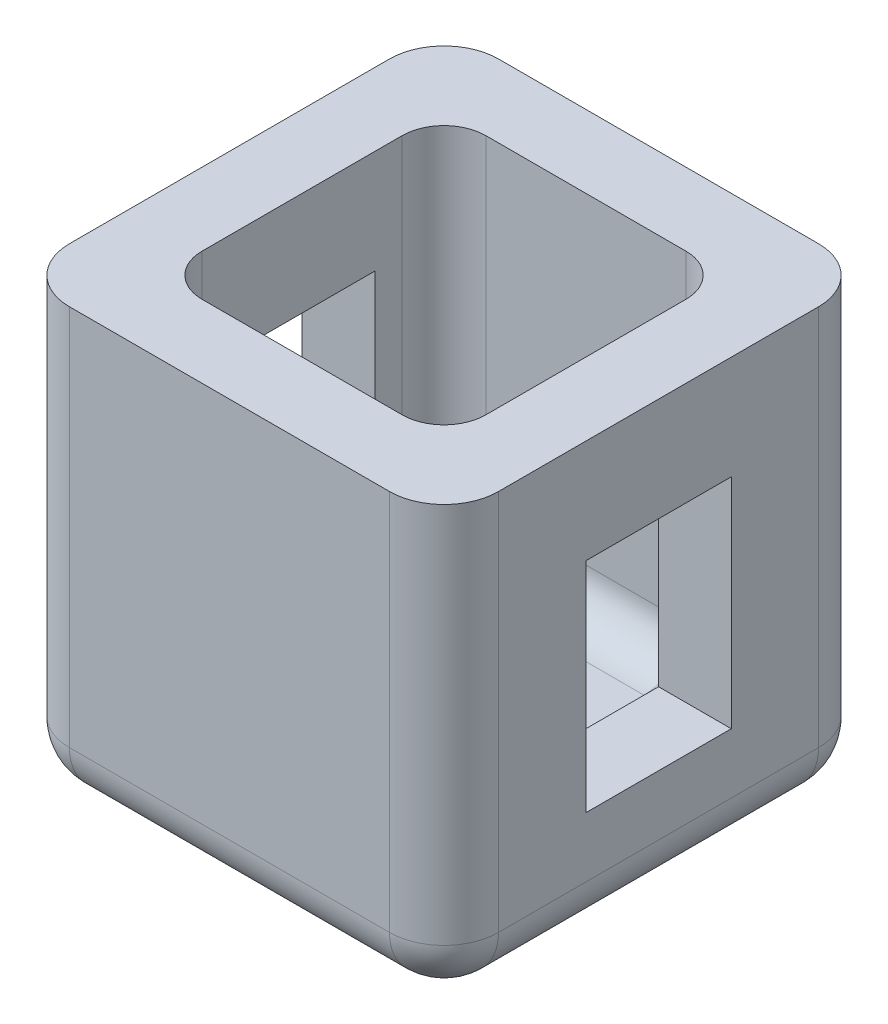
ISO-10303-21;
HEADER;
FILE_DESCRIPTION(('STEP AP214'),'2;1');
FILE_NAME('part.step','',(''),(''),'','','');
FILE_SCHEMA(('AUTOMOTIVE_DESIGN { 1 0 10303 214 1 1 1 1 }'));
ENDSEC;
DATA;
#1=APPLICATION_CONTEXT('core data for automotive mechanical design processes');
#2=APPLICATION_PROTOCOL_DEFINITION('international standard','automotive_design',2000,#1);
#3=PRODUCT_CONTEXT('',#1,'mechanical');
#4=PRODUCT('Part','Part','',(#3));
#5=PRODUCT_RELATED_PRODUCT_CATEGORY('part','',(#4));
#6=PRODUCT_DEFINITION_FORMATION('','',#4);
#7=PRODUCT_DEFINITION_CONTEXT('part definition',#1,'design');
#8=PRODUCT_DEFINITION('design','',#6,#7);
#9=PRODUCT_DEFINITION_SHAPE('','',#8);
#10=(LENGTH_UNIT() NAMED_UNIT(*) SI_UNIT(.MILLI.,.METRE.));
#11=(NAMED_UNIT(*) PLANE_ANGLE_UNIT() SI_UNIT($,.RADIAN.));
#12=(NAMED_UNIT(*) SI_UNIT($,.STERADIAN.) SOLID_ANGLE_UNIT());
#13=UNCERTAINTY_MEASURE_WITH_UNIT(LENGTH_MEASURE(1.E-05),#10,'distance_accuracy_value','');
#14=(GEOMETRIC_REPRESENTATION_CONTEXT(3) GLOBAL_UNCERTAINTY_ASSIGNED_CONTEXT((#13)) GLOBAL_UNIT_ASSIGNED_CONTEXT((#10,
#11,#12)) REPRESENTATION_CONTEXT('',''));
#15=CARTESIAN_POINT('',(0.,0.,0.));
#16=DIRECTION('',(0.,0.,1.));
#17=DIRECTION('',(1.,0.,0.));
#18=AXIS2_PLACEMENT_3D('',#15,#16,#17);
#19=CARTESIAN_POINT('',(-115.468503937008,240.,-69.6702755905512));
#20=DIRECTION('',(1.,0.,0.));
#21=DIRECTION('',(0.,0.,-1.));
#22=AXIS2_PLACEMENT_3D('',#19,#20,#21);
#23=PLANE('',#22);
#24=DIRECTION('',(0.,0.,1.));
#25=VECTOR('',#24,1.);
#26=CARTESIAN_POINT('',(-115.468503937008,183.,-69.6702755905512));
#27=LINE('',#26,#25);
#28=CARTESIAN_POINT('',(-115.468503937008,183.,8.32972440944884));
#29=VERTEX_POINT('',#28);
#30=CARTESIAN_POINT('',(-115.468503937008,183.,88.3297244094488));
#31=VERTEX_POINT('',#30);
#32=EDGE_CURVE('E300',#29,#31,#27,.T.);
#33=ORIENTED_EDGE('',*,*,#32,.T.);
#34=DIRECTION('',(0.,-1.,0.));
#35=VECTOR('',#34,1.);
#36=CARTESIAN_POINT('',(-115.468503937008,240.,88.3297244094488));
#37=LINE('',#36,#35);
#38=CARTESIAN_POINT('',(-115.468503937008,63.,88.3297244094488));
#39=VERTEX_POINT('',#38);
#40=EDGE_CURVE('E293',#31,#39,#37,.T.);
#41=ORIENTED_EDGE('',*,*,#40,.T.);
#42=DIRECTION('',(0.,0.,-1.));
#43=VECTOR('',#42,1.);
#44=CARTESIAN_POINT('',(-115.468503937008,63.,-69.6702755905512));
#45=LINE('',#44,#43);
#46=CARTESIAN_POINT('',(-115.468503937008,63.,8.32972440944879));
#47=VERTEX_POINT('',#46);
#48=EDGE_CURVE('E273',#39,#47,#45,.T.);
#49=ORIENTED_EDGE('',*,*,#48,.T.);
#50=DIRECTION('',(0.,1.,0.));
#51=VECTOR('',#50,1.);
#52=CARTESIAN_POINT('',(-115.468503937008,240.,8.32972440944886));
#53=LINE('',#52,#51);
#54=EDGE_CURVE('E282',#47,#29,#53,.T.);
#55=ORIENTED_EDGE('',*,*,#54,.T.);
#56=EDGE_LOOP('',(#33,#41,#49,#55));
#57=FACE_BOUND('',#56,.T.);
#58=DIRECTION('',(0.,0.,1.));
#59=VECTOR('',#58,1.);
#60=CARTESIAN_POINT('',(-115.468503937008,240.,-69.6702755905512));
#61=LINE('',#60,#59);
#62=CARTESIAN_POINT('',(-115.468503937008,240.,-39.6702755905512));
#63=VERTEX_POINT('',#62);
#64=CARTESIAN_POINT('',(-115.468503937008,240.,136.329724409449));
#65=VERTEX_POINT('',#64);
#66=EDGE_CURVE('E322',#63,#65,#61,.T.);
#67=ORIENTED_EDGE('',*,*,#66,.F.);
#68=DIRECTION('',(0.,-1.,0.));
#69=VECTOR('',#68,1.);
#70=CARTESIAN_POINT('',(-115.468503937008,240.,-39.6702755905512));
#71=LINE('',#70,#69);
#72=CARTESIAN_POINT('',(-115.468503937008,30.,-39.6702755905512));
#73=VERTEX_POINT('',#72);
#74=EDGE_CURVE('E498',#63,#73,#71,.T.);
#75=ORIENTED_EDGE('',*,*,#74,.T.);
#76=DIRECTION('',(0.,0.,1.));
#77=VECTOR('',#76,1.);
#78=CARTESIAN_POINT('',(-115.468503937008,30.,-69.6702755905512));
#79=LINE('',#78,#77);
#80=CARTESIAN_POINT('',(-115.468503937008,30.,136.329724409449));
#81=VERTEX_POINT('',#80);
#82=EDGE_CURVE('E495',#73,#81,#79,.T.);
#83=ORIENTED_EDGE('',*,*,#82,.T.);
#84=DIRECTION('',(0.,-1.,0.));
#85=VECTOR('',#84,1.);
#86=CARTESIAN_POINT('',(-115.468503937008,240.,136.329724409449));
#87=LINE('',#86,#85);
#88=EDGE_CURVE('E492',#81,#65,#87,.F.);
#89=ORIENTED_EDGE('',*,*,#88,.T.);
#90=EDGE_LOOP('',(#67,#75,#83,#89));
#91=FACE_BOUND('',#90,.T.);
#92=ADVANCED_FACE('F43',(#57,#91),#23,.F.);
#93=CARTESIAN_POINT('',(-115.468503937008,240.,166.329724409449));
#94=DIRECTION('',(0.,0.,-1.));
#95=DIRECTION('',(-1.,0.,0.));
#96=AXIS2_PLACEMENT_3D('',#93,#94,#95);
#97=PLANE('',#96);
#98=DIRECTION('',(1.,0.,0.));
#99=VECTOR('',#98,1.);
#100=CARTESIAN_POINT('',(-115.468503937008,240.,166.329724409449));
#101=LINE('',#100,#99);
#102=CARTESIAN_POINT('',(-85.4685039370078,240.,166.329724409449));
#103=VERTEX_POINT('',#102);
#104=CARTESIAN_POINT('',(90.5314960629922,240.,166.329724409449));
#105=VERTEX_POINT('',#104);
#106=EDGE_CURVE('E326',#103,#105,#101,.T.);
#107=ORIENTED_EDGE('',*,*,#106,.F.);
#108=DIRECTION('',(0.,-1.,0.));
#109=VECTOR('',#108,1.);
#110=CARTESIAN_POINT('',(-85.4685039370078,240.,166.329724409449));
#111=LINE('',#110,#109);
#112=CARTESIAN_POINT('',(-85.4685039370078,30.,166.329724409449));
#113=VERTEX_POINT('',#112);
#114=EDGE_CURVE('E458',#103,#113,#111,.T.);
#115=ORIENTED_EDGE('',*,*,#114,.T.);
#116=DIRECTION('',(1.,0.,0.));
#117=VECTOR('',#116,1.);
#118=CARTESIAN_POINT('',(-115.468503937008,30.,166.329724409449));
#119=LINE('',#118,#117);
#120=CARTESIAN_POINT('',(90.5314960629922,30.,166.329724409449));
#121=VERTEX_POINT('',#120);
#122=EDGE_CURVE('E454',#113,#121,#119,.T.);
#123=ORIENTED_EDGE('',*,*,#122,.T.);
#124=DIRECTION('',(0.,-1.,0.));
#125=VECTOR('',#124,1.);
#126=CARTESIAN_POINT('',(90.5314960629922,240.,166.329724409449));
#127=LINE('',#126,#125);
#128=EDGE_CURVE('E405',#121,#105,#127,.F.);
#129=ORIENTED_EDGE('',*,*,#128,.T.);
#130=EDGE_LOOP('',(#107,#115,#123,#129));
#131=FACE_BOUND('',#130,.T.);
#132=ADVANCED_FACE('F582',(#131),#97,.F.);
#133=CARTESIAN_POINT('',(120.531496062992,240.,-69.6702755905512));
#134=DIRECTION('',(-1.,0.,0.));
#135=DIRECTION('',(0.,0.,1.));
#136=AXIS2_PLACEMENT_3D('',#133,#134,#135);
#137=PLANE('',#136);
#138=DIRECTION('',(0.,0.,-1.));
#139=VECTOR('',#138,1.);
#140=CARTESIAN_POINT('',(120.531496062992,63.,88.3297244094488));
#141=LINE('',#140,#139);
#142=CARTESIAN_POINT('',(120.531496062992,63.,88.3297244094488));
#143=VERTEX_POINT('',#142);
#144=CARTESIAN_POINT('',(120.531496062992,63.,8.32972440944878));
#145=VERTEX_POINT('',#144);
#146=EDGE_CURVE('E244',#143,#145,#141,.T.);
#147=ORIENTED_EDGE('',*,*,#146,.F.);
#148=DIRECTION('',(0.,-1.,0.));
#149=VECTOR('',#148,1.);
#150=CARTESIAN_POINT('',(120.531496062992,183.,88.3297244094488));
#151=LINE('',#150,#149);
#152=CARTESIAN_POINT('',(120.531496062992,183.,88.3297244094488));
#153=VERTEX_POINT('',#152);
#154=EDGE_CURVE('E67',#153,#143,#151,.T.);
#155=ORIENTED_EDGE('',*,*,#154,.F.);
#156=DIRECTION('',(0.,0.,1.));
#157=VECTOR('',#156,1.);
#158=CARTESIAN_POINT('',(120.531496062992,183.,88.3297244094488));
#159=LINE('',#158,#157);
#160=CARTESIAN_POINT('',(120.531496062992,183.,8.32972440944883));
#161=VERTEX_POINT('',#160);
#162=EDGE_CURVE('E253',#161,#153,#159,.T.);
#163=ORIENTED_EDGE('',*,*,#162,.F.);
#164=DIRECTION('',(0.,1.,0.));
#165=VECTOR('',#164,1.);
#166=CARTESIAN_POINT('',(120.531496062992,183.,8.32972440944883));
#167=LINE('',#166,#165);
#168=EDGE_CURVE('E234',#145,#161,#167,.T.);
#169=ORIENTED_EDGE('',*,*,#168,.F.);
#170=EDGE_LOOP('',(#147,#155,#163,#169));
#171=FACE_BOUND('',#170,.T.);
#172=DIRECTION('',(0.,0.,-1.));
#173=VECTOR('',#172,1.);
#174=CARTESIAN_POINT('',(120.531496062992,30.,-69.6702755905512));
#175=LINE('',#174,#173);
#176=CARTESIAN_POINT('',(120.531496062992,30.,136.329724409449));
#177=VERTEX_POINT('',#176);
#178=CARTESIAN_POINT('',(120.531496062992,30.,-39.6702755905512));
#179=VERTEX_POINT('',#178);
#180=EDGE_CURVE('E477',#177,#179,#175,.T.);
#181=ORIENTED_EDGE('',*,*,#180,.T.);
#182=DIRECTION('',(0.,-1.,0.));
#183=VECTOR('',#182,1.);
#184=CARTESIAN_POINT('',(120.531496062992,240.,-39.6702755905512));
#185=LINE('',#184,#183);
#186=CARTESIAN_POINT('',(120.531496062992,240.,-39.6702755905512));
#187=VERTEX_POINT('',#186);
#188=EDGE_CURVE('E480',#179,#187,#185,.F.);
#189=ORIENTED_EDGE('',*,*,#188,.T.);
#190=DIRECTION('',(0.,0.,-1.));
#191=VECTOR('',#190,1.);
#192=CARTESIAN_POINT('',(120.531496062992,240.,-69.6702755905512));
#193=LINE('',#192,#191);
#194=CARTESIAN_POINT('',(120.531496062992,240.,136.329724409449));
#195=VERTEX_POINT('',#194);
#196=EDGE_CURVE('E330',#195,#187,#193,.T.);
#197=ORIENTED_EDGE('',*,*,#196,.F.);
#198=DIRECTION('',(0.,-1.,0.));
#199=VECTOR('',#198,1.);
#200=CARTESIAN_POINT('',(120.531496062992,240.,136.329724409449));
#201=LINE('',#200,#199);
#202=EDGE_CURVE('E474',#195,#177,#201,.T.);
#203=ORIENTED_EDGE('',*,*,#202,.T.);
#204=EDGE_LOOP('',(#181,#189,#197,#203));
#205=FACE_BOUND('',#204,.T.);
#206=ADVANCED_FACE('F250',(#171,#205),#137,.F.);
#207=CARTESIAN_POINT('',(-115.468503937008,240.,-69.6702755905512));
#208=DIRECTION('',(0.,0.,1.));
#209=DIRECTION('',(1.,0.,0.));
#210=AXIS2_PLACEMENT_3D('',#207,#208,#209);
#211=PLANE('',#210);
#212=DIRECTION('',(-1.,0.,0.));
#213=VECTOR('',#212,1.);
#214=CARTESIAN_POINT('',(-115.468503937008,30.,-69.6702755905512));
#215=LINE('',#214,#213);
#216=CARTESIAN_POINT('',(90.5314960629922,30.,-69.6702755905512));
#217=VERTEX_POINT('',#216);
#218=CARTESIAN_POINT('',(-85.4685039370079,30.,-69.6702755905512));
#219=VERTEX_POINT('',#218);
#220=EDGE_CURVE('E486',#217,#219,#215,.T.);
#221=ORIENTED_EDGE('',*,*,#220,.T.);
#222=DIRECTION('',(0.,-1.,0.));
#223=VECTOR('',#222,1.);
#224=CARTESIAN_POINT('',(-85.4685039370079,240.,-69.6702755905512));
#225=LINE('',#224,#223);
#226=CARTESIAN_POINT('',(-85.4685039370079,240.,-69.6702755905512));
#227=VERTEX_POINT('',#226);
#228=EDGE_CURVE('E489',#219,#227,#225,.F.);
#229=ORIENTED_EDGE('',*,*,#228,.T.);
#230=DIRECTION('',(-1.,0.,0.));
#231=VECTOR('',#230,1.);
#232=CARTESIAN_POINT('',(-115.468503937008,240.,-69.6702755905512));
#233=LINE('',#232,#231);
#234=CARTESIAN_POINT('',(90.5314960629921,240.,-69.6702755905512));
#235=VERTEX_POINT('',#234);
#236=EDGE_CURVE('E334',#235,#227,#233,.T.);
#237=ORIENTED_EDGE('',*,*,#236,.F.);
#238=DIRECTION('',(0.,-1.,0.));
#239=VECTOR('',#238,1.);
#240=CARTESIAN_POINT('',(90.5314960629922,240.,-69.6702755905512));
#241=LINE('',#240,#239);
#242=EDGE_CURVE('E483',#235,#217,#241,.T.);
#243=ORIENTED_EDGE('',*,*,#242,.T.);
#244=EDGE_LOOP('',(#221,#229,#237,#243));
#245=FACE_BOUND('',#244,.T.);
#246=ADVANCED_FACE('F611',(#245),#211,.F.);
#247=CARTESIAN_POINT('',(0.,240.,0.));
#248=DIRECTION('',(0.,1.,0.));
#249=DIRECTION('',(0.,0.,1.));
#250=AXIS2_PLACEMENT_3D('',#247,#248,#249);
#251=PLANE('',#250);
#252=DIRECTION('',(0.,0.,1.));
#253=VECTOR('',#252,1.);
#254=CARTESIAN_POINT('',(-75.4685039370079,240.,-69.6702755905512));
#255=LINE('',#254,#253);
#256=CARTESIAN_POINT('',(-75.4685039370078,240.,-6.67027559055121));
#257=VERTEX_POINT('',#256);
#258=CARTESIAN_POINT('',(-75.4685039370078,240.,103.329724409449));
#259=VERTEX_POINT('',#258);
#260=EDGE_CURVE('E305',#257,#259,#255,.T.);
#261=ORIENTED_EDGE('',*,*,#260,.F.);
#262=CARTESIAN_POINT('',(-52.4685039370079,240.,-6.6702755905512));
#263=DIRECTION('',(0.,1.,0.));
#264=DIRECTION('',(0.,0.,1.));
#265=AXIS2_PLACEMENT_3D('',#262,#263,#264);
#266=CIRCLE('',#265,23.);
#267=CARTESIAN_POINT('',(-52.4685039370079,240.,-29.6702755905512));
#268=VERTEX_POINT('',#267);
#269=EDGE_CURVE('E402',#257,#268,#266,.F.);
#270=ORIENTED_EDGE('',*,*,#269,.T.);
#271=DIRECTION('',(-1.,0.,0.));
#272=VECTOR('',#271,1.);
#273=CARTESIAN_POINT('',(-115.468503937008,240.,-29.6702755905512));
#274=LINE('',#273,#272);
#275=CARTESIAN_POINT('',(57.5314960629922,240.,-29.6702755905512));
#276=VERTEX_POINT('',#275);
#277=EDGE_CURVE('E318',#276,#268,#274,.T.);
#278=ORIENTED_EDGE('',*,*,#277,.F.);
#279=CARTESIAN_POINT('',(57.5314960629922,240.,-6.67027559055122));
#280=DIRECTION('',(0.,1.,0.));
#281=DIRECTION('',(0.,0.,1.));
#282=AXIS2_PLACEMENT_3D('',#279,#280,#281);
#283=CIRCLE('',#282,23.);
#284=CARTESIAN_POINT('',(80.5314960629922,240.,-6.67027559055122));
#285=VERTEX_POINT('',#284);
#286=EDGE_CURVE('E393',#276,#285,#283,.F.);
#287=ORIENTED_EDGE('',*,*,#286,.T.);
#288=DIRECTION('',(0.,0.,-1.));
#289=VECTOR('',#288,1.);
#290=CARTESIAN_POINT('',(80.5314960629922,240.,-69.6702755905512));
#291=LINE('',#290,#289);
#292=CARTESIAN_POINT('',(80.5314960629922,240.,103.329724409449));
#293=VERTEX_POINT('',#292);
#294=EDGE_CURVE('E314',#293,#285,#291,.T.);
#295=ORIENTED_EDGE('',*,*,#294,.F.);
#296=CARTESIAN_POINT('',(57.5314960629922,240.,103.329724409449));
#297=DIRECTION('',(0.,1.,0.));
#298=DIRECTION('',(0.,0.,1.));
#299=AXIS2_PLACEMENT_3D('',#296,#297,#298);
#300=CIRCLE('',#299,23.);
#301=CARTESIAN_POINT('',(57.5314960629922,240.,126.329724409449));
#302=VERTEX_POINT('',#301);
#303=EDGE_CURVE('E396',#293,#302,#300,.F.);
#304=ORIENTED_EDGE('',*,*,#303,.T.);
#305=DIRECTION('',(1.,0.,0.));
#306=VECTOR('',#305,1.);
#307=CARTESIAN_POINT('',(-115.468503937008,240.,126.329724409449));
#308=LINE('',#307,#306);
#309=CARTESIAN_POINT('',(-52.4685039370078,240.,126.329724409449));
#310=VERTEX_POINT('',#309);
#311=EDGE_CURVE('E309',#310,#302,#308,.T.);
#312=ORIENTED_EDGE('',*,*,#311,.F.);
#313=CARTESIAN_POINT('',(-52.4685039370078,240.,103.329724409449));
#314=DIRECTION('',(0.,1.,0.));
#315=DIRECTION('',(0.,0.,1.));
#316=AXIS2_PLACEMENT_3D('',#313,#314,#315);
#317=CIRCLE('',#316,23.);
#318=EDGE_CURVE('E399',#310,#259,#317,.F.);
#319=ORIENTED_EDGE('',*,*,#318,.T.);
#320=EDGE_LOOP('',(#261,#270,#278,#287,#295,#304,#312,#319));
#321=FACE_BOUND('',#320,.T.);
#322=ORIENTED_EDGE('',*,*,#236,.T.);
#323=CARTESIAN_POINT('',(-85.4685039370079,240.,-39.6702755905512));
#324=DIRECTION('',(0.,1.,0.));
#325=DIRECTION('',(0.,0.,1.));
#326=AXIS2_PLACEMENT_3D('',#323,#324,#325);
#327=CIRCLE('',#326,30.);
#328=EDGE_CURVE('E52',#227,#63,#327,.T.);
#329=ORIENTED_EDGE('',*,*,#328,.T.);
#330=ORIENTED_EDGE('',*,*,#66,.T.);
#331=CARTESIAN_POINT('',(-85.4685039370078,240.,136.329724409449));
#332=DIRECTION('',(0.,1.,0.));
#333=DIRECTION('',(0.,0.,1.));
#334=AXIS2_PLACEMENT_3D('',#331,#332,#333);
#335=CIRCLE('',#334,30.);
#336=EDGE_CURVE('E504',#65,#103,#335,.T.);
#337=ORIENTED_EDGE('',*,*,#336,.T.);
#338=ORIENTED_EDGE('',*,*,#106,.T.);
#339=CARTESIAN_POINT('',(90.5314960629922,240.,136.329724409449));
#340=DIRECTION('',(0.,1.,0.));
#341=DIRECTION('',(0.,0.,1.));
#342=AXIS2_PLACEMENT_3D('',#339,#340,#341);
#343=CIRCLE('',#342,30.);
#344=EDGE_CURVE('E501',#105,#195,#343,.T.);
#345=ORIENTED_EDGE('',*,*,#344,.T.);
#346=ORIENTED_EDGE('',*,*,#196,.T.);
#347=CARTESIAN_POINT('',(90.5314960629922,240.,-39.6702755905512));
#348=DIRECTION('',(0.,1.,0.));
#349=DIRECTION('',(0.,0.,1.));
#350=AXIS2_PLACEMENT_3D('',#347,#348,#349);
#351=CIRCLE('',#350,30.);
#352=EDGE_CURVE('E507',#187,#235,#351,.T.);
#353=ORIENTED_EDGE('',*,*,#352,.T.);
#354=EDGE_LOOP('',(#322,#329,#330,#337,#338,#345,#346,#353));
#355=FACE_BOUND('',#354,.T.);
#356=ADVANCED_FACE('F579',(#321,#355),#251,.T.);
#357=CARTESIAN_POINT('',(0.,0.,0.));
#358=DIRECTION('',(0.,1.,0.));
#359=DIRECTION('',(0.,0.,1.));
#360=AXIS2_PLACEMENT_3D('',#357,#358,#359);
#361=PLANE('',#360);
#362=DIRECTION('',(0.,0.,-1.));
#363=VECTOR('',#362,1.);
#364=CARTESIAN_POINT('',(90.5314960629922,0.,0.));
#365=LINE('',#364,#363);
#366=CARTESIAN_POINT('',(90.5314960629922,0.,-39.6702755905512));
#367=VERTEX_POINT('',#366);
#368=CARTESIAN_POINT('',(90.5314960629922,0.,136.329724409449));
#369=VERTEX_POINT('',#368);
#370=EDGE_CURVE('E467',#367,#369,#365,.F.);
#371=ORIENTED_EDGE('',*,*,#370,.T.);
#372=DIRECTION('',(1.,0.,0.));
#373=VECTOR('',#372,1.);
#374=CARTESIAN_POINT('',(0.,0.,136.329724409449));
#375=LINE('',#374,#373);
#376=CARTESIAN_POINT('',(-85.4685039370078,0.,136.329724409449));
#377=VERTEX_POINT('',#376);
#378=EDGE_CURVE('E470',#369,#377,#375,.F.);
#379=ORIENTED_EDGE('',*,*,#378,.T.);
#380=DIRECTION('',(0.,0.,1.));
#381=VECTOR('',#380,1.);
#382=CARTESIAN_POINT('',(-85.4685039370078,0.,0.));
#383=LINE('',#382,#381);
#384=CARTESIAN_POINT('',(-85.4685039370079,0.,-39.6702755905512));
#385=VERTEX_POINT('',#384);
#386=EDGE_CURVE('E461',#377,#385,#383,.F.);
#387=ORIENTED_EDGE('',*,*,#386,.T.);
#388=DIRECTION('',(-1.,0.,0.));
#389=VECTOR('',#388,1.);
#390=CARTESIAN_POINT('',(0.,0.,-39.6702755905512));
#391=LINE('',#390,#389);
#392=EDGE_CURVE('E464',#385,#367,#391,.F.);
#393=ORIENTED_EDGE('',*,*,#392,.T.);
#394=EDGE_LOOP('',(#371,#379,#387,#393));
#395=FACE_BOUND('',#394,.T.);
#396=ADVANCED_FACE('F607',(#395),#361,.F.);
#397=CARTESIAN_POINT('',(-75.4685039370079,240.,-69.6702755905512));
#398=DIRECTION('',(1.,0.,0.));
#399=DIRECTION('',(0.,0.,-1.));
#400=AXIS2_PLACEMENT_3D('',#397,#398,#399);
#401=PLANE('',#400);
#402=DIRECTION('',(0.,-1.,0.));
#403=VECTOR('',#402,1.);
#404=CARTESIAN_POINT('',(-75.4685039370078,240.,88.3297244094488));
#405=LINE('',#404,#403);
#406=CARTESIAN_POINT('',(-75.4685039370078,183.,88.3297244094488));
#407=VERTEX_POINT('',#406);
#408=CARTESIAN_POINT('',(-75.4685039370078,63.,88.3297244094488));
#409=VERTEX_POINT('',#408);
#410=EDGE_CURVE('E289',#407,#409,#405,.T.);
#411=ORIENTED_EDGE('',*,*,#410,.F.);
#412=DIRECTION('',(0.,0.,1.));
#413=VECTOR('',#412,1.);
#414=CARTESIAN_POINT('',(-75.4685039370079,183.,-69.6702755905512));
#415=LINE('',#414,#413);
#416=CARTESIAN_POINT('',(-75.4685039370078,183.,8.32972440944884));
#417=VERTEX_POINT('',#416);
#418=EDGE_CURVE('E297',#417,#407,#415,.T.);
#419=ORIENTED_EDGE('',*,*,#418,.F.);
#420=DIRECTION('',(0.,1.,0.));
#421=VECTOR('',#420,1.);
#422=CARTESIAN_POINT('',(-75.4685039370078,240.,8.32972440944886));
#423=LINE('',#422,#421);
#424=CARTESIAN_POINT('',(-75.4685039370079,63.,8.3297244094488));
#425=VERTEX_POINT('',#424);
#426=EDGE_CURVE('E279',#425,#417,#423,.T.);
#427=ORIENTED_EDGE('',*,*,#426,.F.);
#428=DIRECTION('',(0.,0.,1.));
#429=VECTOR('',#428,1.);
#430=CARTESIAN_POINT('',(-75.4685039370079,63.,-29.6702755905512));
#431=LINE('',#430,#429);
#432=CARTESIAN_POINT('',(-75.4685039370078,63.,-6.6702755905512));
#433=VERTEX_POINT('',#432);
#434=EDGE_CURVE('E384',#425,#433,#431,.F.);
#435=ORIENTED_EDGE('',*,*,#434,.T.);
#436=DIRECTION('',(0.,-1.,0.));
#437=VECTOR('',#436,1.);
#438=CARTESIAN_POINT('',(-75.4685039370078,240.,-6.6702755905512));
#439=LINE('',#438,#437);
#440=EDGE_CURVE('E381',#433,#257,#439,.F.);
#441=ORIENTED_EDGE('',*,*,#440,.T.);
#442=ORIENTED_EDGE('',*,*,#260,.T.);
#443=DIRECTION('',(0.,-1.,0.));
#444=VECTOR('',#443,1.);
#445=CARTESIAN_POINT('',(-75.4685039370078,40.,103.329724409449));
#446=LINE('',#445,#444);
#447=CARTESIAN_POINT('',(-75.4685039370078,63.,103.329724409449));
#448=VERTEX_POINT('',#447);
#449=EDGE_CURVE('E389',#259,#448,#446,.T.);
#450=ORIENTED_EDGE('',*,*,#449,.T.);
#451=EDGE_CURVE('E385',#448,#409,#431,.F.);
#452=ORIENTED_EDGE('',*,*,#451,.T.);
#453=EDGE_LOOP('',(#411,#419,#427,#435,#441,#442,#450,#452));
#454=FACE_BOUND('',#453,.T.);
#455=ADVANCED_FACE('F1009',(#454),#401,.T.);
#456=CARTESIAN_POINT('',(-115.468503937008,240.,126.329724409449));
#457=DIRECTION('',(0.,0.,-1.));
#458=DIRECTION('',(-1.,0.,0.));
#459=AXIS2_PLACEMENT_3D('',#456,#457,#458);
#460=PLANE('',#459);
#461=ORIENTED_EDGE('',*,*,#311,.T.);
#462=DIRECTION('',(0.,-1.,0.));
#463=VECTOR('',#462,1.);
#464=CARTESIAN_POINT('',(57.5314960629922,40.,126.329724409449));
#465=LINE('',#464,#463);
#466=CARTESIAN_POINT('',(57.5314960629922,63.,126.329724409449));
#467=VERTEX_POINT('',#466);
#468=EDGE_CURVE('E378',#302,#467,#465,.T.);
#469=ORIENTED_EDGE('',*,*,#468,.T.);
#470=DIRECTION('',(1.,0.,0.));
#471=VECTOR('',#470,1.);
#472=CARTESIAN_POINT('',(-75.4685039370078,63.,126.329724409449));
#473=LINE('',#472,#471);
#474=CARTESIAN_POINT('',(-52.4685039370078,63.,126.329724409449));
#475=VERTEX_POINT('',#474);
#476=EDGE_CURVE('E375',#467,#475,#473,.F.);
#477=ORIENTED_EDGE('',*,*,#476,.T.);
#478=DIRECTION('',(0.,-1.,0.));
#479=VECTOR('',#478,1.);
#480=CARTESIAN_POINT('',(-52.4685039370078,240.,126.329724409449));
#481=LINE('',#480,#479);
#482=EDGE_CURVE('E372',#475,#310,#481,.F.);
#483=ORIENTED_EDGE('',*,*,#482,.T.);
#484=EDGE_LOOP('',(#461,#469,#477,#483));
#485=FACE_BOUND('',#484,.T.);
#486=ADVANCED_FACE('F998',(#485),#460,.T.);
#487=CARTESIAN_POINT('',(80.5314960629922,240.,-69.6702755905512));
#488=DIRECTION('',(-1.,0.,0.));
#489=DIRECTION('',(0.,0.,1.));
#490=AXIS2_PLACEMENT_3D('',#487,#488,#489);
#491=PLANE('',#490);
#492=DIRECTION('',(0.,1.,0.));
#493=VECTOR('',#492,1.);
#494=CARTESIAN_POINT('',(80.5314960629922,240.,88.3297244094488));
#495=LINE('',#494,#493);
#496=CARTESIAN_POINT('',(80.5314960629922,63.,88.3297244094488));
#497=VERTEX_POINT('',#496);
#498=CARTESIAN_POINT('',(80.5314960629922,183.,88.3297244094488));
#499=VERTEX_POINT('',#498);
#500=EDGE_CURVE('E286',#497,#499,#495,.T.);
#501=ORIENTED_EDGE('',*,*,#500,.F.);
#502=DIRECTION('',(0.,0.,-1.));
#503=VECTOR('',#502,1.);
#504=CARTESIAN_POINT('',(80.5314960629922,63.,126.329724409449));
#505=LINE('',#504,#503);
#506=CARTESIAN_POINT('',(80.5314960629922,63.,103.329724409449));
#507=VERTEX_POINT('',#506);
#508=EDGE_CURVE('E364',#497,#507,#505,.F.);
#509=ORIENTED_EDGE('',*,*,#508,.T.);
#510=DIRECTION('',(0.,-1.,0.));
#511=VECTOR('',#510,1.);
#512=CARTESIAN_POINT('',(80.5314960629922,240.,103.329724409449));
#513=LINE('',#512,#511);
#514=EDGE_CURVE('E361',#507,#293,#513,.F.);
#515=ORIENTED_EDGE('',*,*,#514,.T.);
#516=ORIENTED_EDGE('',*,*,#294,.T.);
#517=DIRECTION('',(0.,-1.,0.));
#518=VECTOR('',#517,1.);
#519=CARTESIAN_POINT('',(80.5314960629922,40.,-6.67027559055122));
#520=LINE('',#519,#518);
#521=CARTESIAN_POINT('',(80.5314960629922,63.,-6.67027559055122));
#522=VERTEX_POINT('',#521);
#523=EDGE_CURVE('E369',#285,#522,#520,.T.);
#524=ORIENTED_EDGE('',*,*,#523,.T.);
#525=CARTESIAN_POINT('',(80.5314960629922,63.,8.32972440944879));
#526=VERTEX_POINT('',#525);
#527=EDGE_CURVE('E365',#522,#526,#505,.F.);
#528=ORIENTED_EDGE('',*,*,#527,.T.);
#529=DIRECTION('',(0.,-1.,0.));
#530=VECTOR('',#529,1.);
#531=CARTESIAN_POINT('',(80.5314960629922,240.,8.32972440944886));
#532=LINE('',#531,#530);
#533=CARTESIAN_POINT('',(80.5314960629922,183.,8.32972440944883));
#534=VERTEX_POINT('',#533);
#535=EDGE_CURVE('E237',#534,#526,#532,.T.);
#536=ORIENTED_EDGE('',*,*,#535,.F.);
#537=DIRECTION('',(0.,0.,-1.));
#538=VECTOR('',#537,1.);
#539=CARTESIAN_POINT('',(80.5314960629922,183.,-69.6702755905512));
#540=LINE('',#539,#538);
#541=EDGE_CURVE('E11',#499,#534,#540,.T.);
#542=ORIENTED_EDGE('',*,*,#541,.F.);
#543=EDGE_LOOP('',(#501,#509,#515,#516,#524,#528,#536,#542));
#544=FACE_BOUND('',#543,.T.);
#545=ADVANCED_FACE('F987',(#544),#491,.T.);
#546=CARTESIAN_POINT('',(-115.468503937008,240.,-29.6702755905512));
#547=DIRECTION('',(0.,0.,1.));
#548=DIRECTION('',(1.,0.,0.));
#549=AXIS2_PLACEMENT_3D('',#546,#547,#548);
#550=PLANE('',#549);
#551=DIRECTION('',(-1.,0.,0.));
#552=VECTOR('',#551,1.);
#553=CARTESIAN_POINT('',(80.5314960629922,63.,-29.6702755905512));
#554=LINE('',#553,#552);
#555=CARTESIAN_POINT('',(-52.4685039370079,63.,-29.6702755905512));
#556=VERTEX_POINT('',#555);
#557=CARTESIAN_POINT('',(57.5314960629922,63.,-29.6702755905512));
#558=VERTEX_POINT('',#557);
#559=EDGE_CURVE('E354',#556,#558,#554,.F.);
#560=ORIENTED_EDGE('',*,*,#559,.T.);
#561=DIRECTION('',(0.,-1.,0.));
#562=VECTOR('',#561,1.);
#563=CARTESIAN_POINT('',(57.5314960629922,240.,-29.6702755905512));
#564=LINE('',#563,#562);
#565=EDGE_CURVE('E358',#558,#276,#564,.F.);
#566=ORIENTED_EDGE('',*,*,#565,.T.);
#567=ORIENTED_EDGE('',*,*,#277,.T.);
#568=DIRECTION('',(0.,-1.,0.));
#569=VECTOR('',#568,1.);
#570=CARTESIAN_POINT('',(-52.4685039370079,40.,-29.6702755905512));
#571=LINE('',#570,#569);
#572=EDGE_CURVE('E351',#268,#556,#571,.T.);
#573=ORIENTED_EDGE('',*,*,#572,.T.);
#574=EDGE_LOOP('',(#560,#566,#567,#573));
#575=FACE_BOUND('',#574,.T.);
#576=ADVANCED_FACE('F976',(#575),#550,.T.);
#577=CARTESIAN_POINT('',(0.,40.,0.));
#578=DIRECTION('',(0.,1.,0.));
#579=DIRECTION('',(0.,0.,1.));
#580=AXIS2_PLACEMENT_3D('',#577,#578,#579);
#581=PLANE('',#580);
#582=DIRECTION('',(0.,0.,-1.));
#583=VECTOR('',#582,1.);
#584=CARTESIAN_POINT('',(57.5314960629922,40.,-29.6702755905512));
#585=LINE('',#584,#583);
#586=CARTESIAN_POINT('',(57.5314960629922,40.,103.329724409449));
#587=VERTEX_POINT('',#586);
#588=CARTESIAN_POINT('',(57.5314960629922,40.,-6.6702755905512));
#589=VERTEX_POINT('',#588);
#590=EDGE_CURVE('E344',#587,#589,#585,.T.);
#591=ORIENTED_EDGE('',*,*,#590,.T.);
#592=DIRECTION('',(-1.,0.,0.));
#593=VECTOR('',#592,1.);
#594=CARTESIAN_POINT('',(-75.4685039370079,40.,-6.6702755905512));
#595=LINE('',#594,#593);
#596=CARTESIAN_POINT('',(-52.4685039370079,40.,-6.6702755905512));
#597=VERTEX_POINT('',#596);
#598=EDGE_CURVE('E347',#589,#597,#595,.T.);
#599=ORIENTED_EDGE('',*,*,#598,.T.);
#600=DIRECTION('',(0.,0.,1.));
#601=VECTOR('',#600,1.);
#602=CARTESIAN_POINT('',(-52.4685039370078,40.,126.329724409449));
#603=LINE('',#602,#601);
#604=CARTESIAN_POINT('',(-52.4685039370078,40.,103.329724409449));
#605=VERTEX_POINT('',#604);
#606=EDGE_CURVE('E338',#597,#605,#603,.T.);
#607=ORIENTED_EDGE('',*,*,#606,.T.);
#608=DIRECTION('',(1.,0.,0.));
#609=VECTOR('',#608,1.);
#610=CARTESIAN_POINT('',(80.5314960629922,40.,103.329724409449));
#611=LINE('',#610,#609);
#612=EDGE_CURVE('E341',#605,#587,#611,.T.);
#613=ORIENTED_EDGE('',*,*,#612,.T.);
#614=EDGE_LOOP('',(#591,#599,#607,#613));
#615=FACE_BOUND('',#614,.T.);
#616=ADVANCED_FACE('F675',(#615),#581,.T.);
#617=CARTESIAN_POINT('',(57.5314960629922,240.,103.329724409449));
#618=DIRECTION('',(0.,1.,0.));
#619=DIRECTION('',(0.,0.,1.));
#620=AXIS2_PLACEMENT_3D('',#617,#618,#619);
#621=CYLINDRICAL_SURFACE('',#620,23.);
#622=ORIENTED_EDGE('',*,*,#303,.F.);
#623=ORIENTED_EDGE('',*,*,#514,.F.);
#624=CARTESIAN_POINT('',(57.5314960629922,63.,103.329724409449));
#625=DIRECTION('',(0.,1.,0.));
#626=DIRECTION('',(0.,0.,1.));
#627=AXIS2_PLACEMENT_3D('',#624,#625,#626);
#628=CIRCLE('',#627,23.);
#629=EDGE_CURVE('E310',#467,#507,#628,.T.);
#630=ORIENTED_EDGE('',*,*,#629,.F.);
#631=ORIENTED_EDGE('',*,*,#468,.F.);
#632=EDGE_LOOP('',(#622,#623,#630,#631));
#633=FACE_BOUND('',#632,.T.);
#634=ADVANCED_FACE('F671',(#633),#621,.F.);
#635=CARTESIAN_POINT('',(0.,63.,103.329724409449));
#636=DIRECTION('',(-1.,0.,0.));
#637=DIRECTION('',(0.,0.,1.));
#638=AXIS2_PLACEMENT_3D('',#635,#636,#637);
#639=CYLINDRICAL_SURFACE('',#638,23.);
#640=CARTESIAN_POINT('',(-52.4685039370078,63.,103.329724409449));
#641=DIRECTION('',(1.,0.,0.));
#642=DIRECTION('',(0.,0.,-1.));
#643=AXIS2_PLACEMENT_3D('',#640,#641,#642);
#644=CIRCLE('',#643,23.);
#645=EDGE_CURVE('E441',#475,#605,#644,.T.);
#646=ORIENTED_EDGE('',*,*,#645,.F.);
#647=ORIENTED_EDGE('',*,*,#476,.F.);
#648=CARTESIAN_POINT('',(57.5314960629922,63.,103.329724409449));
#649=DIRECTION('',(-1.,0.,0.));
#650=DIRECTION('',(0.,0.,1.));
#651=AXIS2_PLACEMENT_3D('',#648,#649,#650);
#652=CIRCLE('',#651,23.);
#653=EDGE_CURVE('E445',#587,#467,#652,.T.);
#654=ORIENTED_EDGE('',*,*,#653,.F.);
#655=ORIENTED_EDGE('',*,*,#612,.F.);
#656=EDGE_LOOP('',(#646,#647,#654,#655));
#657=FACE_BOUND('',#656,.T.);
#658=ADVANCED_FACE('F667',(#657),#639,.F.);
#659=CARTESIAN_POINT('',(-52.4685039370078,240.,103.329724409449));
#660=DIRECTION('',(0.,1.,0.));
#661=DIRECTION('',(0.,0.,1.));
#662=AXIS2_PLACEMENT_3D('',#659,#660,#661);
#663=CYLINDRICAL_SURFACE('',#662,23.);
#664=ORIENTED_EDGE('',*,*,#318,.F.);
#665=ORIENTED_EDGE('',*,*,#482,.F.);
#666=CARTESIAN_POINT('',(-52.4685039370078,63.,103.329724409449));
#667=DIRECTION('',(0.,1.,0.));
#668=DIRECTION('',(0.,0.,1.));
#669=AXIS2_PLACEMENT_3D('',#666,#667,#668);
#670=CIRCLE('',#669,23.);
#671=EDGE_CURVE('E437',#448,#475,#670,.T.);
#672=ORIENTED_EDGE('',*,*,#671,.F.);
#673=ORIENTED_EDGE('',*,*,#449,.F.);
#674=EDGE_LOOP('',(#664,#665,#672,#673));
#675=FACE_BOUND('',#674,.T.);
#676=ADVANCED_FACE('F663',(#675),#663,.F.);
#677=CARTESIAN_POINT('',(57.5314960629922,63.,103.329724409449));
#678=DIRECTION('',(0.,0.,1.));
#679=DIRECTION('',(1.,0.,0.));
#680=AXIS2_PLACEMENT_3D('',#677,#678,#679);
#681=SPHERICAL_SURFACE('',#680,23.);
#682=ORIENTED_EDGE('',*,*,#653,.T.);
#683=ORIENTED_EDGE('',*,*,#629,.T.);
#684=CARTESIAN_POINT('',(57.5314960629922,63.,103.329724409449));
#685=DIRECTION('',(0.,0.,-1.));
#686=DIRECTION('',(-1.,0.,0.));
#687=AXIS2_PLACEMENT_3D('',#684,#685,#686);
#688=CIRCLE('',#687,23.);
#689=EDGE_CURVE('E433',#587,#507,#688,.F.);
#690=ORIENTED_EDGE('',*,*,#689,.F.);
#691=EDGE_LOOP('',(#682,#683,#690));
#692=FACE_BOUND('',#691,.T.);
#693=ADVANCED_FACE('F659',(#692),#681,.F.);
#694=CARTESIAN_POINT('',(-52.4685039370078,63.,103.329724409449));
#695=DIRECTION('',(0.,0.,1.));
#696=DIRECTION('',(1.,0.,0.));
#697=AXIS2_PLACEMENT_3D('',#694,#695,#696);
#698=SPHERICAL_SURFACE('',#697,23.);
#699=ORIENTED_EDGE('',*,*,#671,.T.);
#700=ORIENTED_EDGE('',*,*,#645,.T.);
#701=CARTESIAN_POINT('',(-52.4685039370078,63.,103.329724409449));
#702=DIRECTION('',(0.,0.,-1.));
#703=DIRECTION('',(-1.,0.,0.));
#704=AXIS2_PLACEMENT_3D('',#701,#702,#703);
#705=CIRCLE('',#704,23.);
#706=EDGE_CURVE('E429',#448,#605,#705,.F.);
#707=ORIENTED_EDGE('',*,*,#706,.F.);
#708=EDGE_LOOP('',(#699,#700,#707));
#709=FACE_BOUND('',#708,.T.);
#710=ADVANCED_FACE('F655',(#709),#698,.F.);
#711=CARTESIAN_POINT('',(57.5314960629922,240.,-6.67027559055122));
#712=DIRECTION('',(0.,1.,0.));
#713=DIRECTION('',(0.,0.,1.));
#714=AXIS2_PLACEMENT_3D('',#711,#712,#713);
#715=CYLINDRICAL_SURFACE('',#714,23.);
#716=ORIENTED_EDGE('',*,*,#286,.F.);
#717=ORIENTED_EDGE('',*,*,#565,.F.);
#718=CARTESIAN_POINT('',(57.5314960629922,63.,-6.67027559055122));
#719=DIRECTION('',(0.,1.,0.));
#720=DIRECTION('',(0.,0.,1.));
#721=AXIS2_PLACEMENT_3D('',#718,#719,#720);
#722=CIRCLE('',#721,23.);
#723=EDGE_CURVE('E425',#522,#558,#722,.T.);
#724=ORIENTED_EDGE('',*,*,#723,.F.);
#725=ORIENTED_EDGE('',*,*,#523,.F.);
#726=EDGE_LOOP('',(#716,#717,#724,#725));
#727=FACE_BOUND('',#726,.T.);
#728=ADVANCED_FACE('F651',(#727),#715,.F.);
#729=CARTESIAN_POINT('',(57.5314960629922,63.,0.));
#730=DIRECTION('',(0.,0.,1.));
#731=DIRECTION('',(1.,0.,0.));
#732=AXIS2_PLACEMENT_3D('',#729,#730,#731);
#733=CYLINDRICAL_SURFACE('',#732,23.);
#734=ORIENTED_EDGE('',*,*,#689,.T.);
#735=ORIENTED_EDGE('',*,*,#508,.F.);
#736=DIRECTION('',(0.,0.,1.));
#737=VECTOR('',#736,1.);
#738=CARTESIAN_POINT('',(80.5314960629922,63.,0.));
#739=LINE('',#738,#737);
#740=EDGE_CURVE('E270',#497,#526,#739,.F.);
#741=ORIENTED_EDGE('',*,*,#740,.T.);
#742=ORIENTED_EDGE('',*,*,#527,.F.);
#743=CARTESIAN_POINT('',(57.5314960629922,63.,-6.6702755905512));
#744=DIRECTION('',(0.,0.,1.));
#745=DIRECTION('',(1.,0.,0.));
#746=AXIS2_PLACEMENT_3D('',#743,#744,#745);
#747=CIRCLE('',#746,23.);
#748=EDGE_CURVE('E421',#589,#522,#747,.T.);
#749=ORIENTED_EDGE('',*,*,#748,.F.);
#750=ORIENTED_EDGE('',*,*,#590,.F.);
#751=EDGE_LOOP('',(#734,#735,#741,#742,#749,#750));
#752=FACE_BOUND('',#751,.T.);
#753=ADVANCED_FACE('F647',(#752),#733,.F.);
#754=CARTESIAN_POINT('',(-52.4685039370079,63.,0.));
#755=DIRECTION('',(0.,0.,-1.));
#756=DIRECTION('',(-1.,0.,0.));
#757=AXIS2_PLACEMENT_3D('',#754,#755,#756);
#758=CYLINDRICAL_SURFACE('',#757,23.);
#759=ORIENTED_EDGE('',*,*,#706,.T.);
#760=ORIENTED_EDGE('',*,*,#606,.F.);
#761=CARTESIAN_POINT('',(-52.4685039370078,63.,-6.6702755905512));
#762=DIRECTION('',(0.,0.,1.));
#763=DIRECTION('',(1.,0.,0.));
#764=AXIS2_PLACEMENT_3D('',#761,#762,#763);
#765=CIRCLE('',#764,23.);
#766=EDGE_CURVE('E417',#433,#597,#765,.T.);
#767=ORIENTED_EDGE('',*,*,#766,.F.);
#768=ORIENTED_EDGE('',*,*,#434,.F.);
#769=EDGE_CURVE('E390',#409,#425,#431,.F.);
#770=ORIENTED_EDGE('',*,*,#769,.F.);
#771=ORIENTED_EDGE('',*,*,#451,.F.);
#772=EDGE_LOOP('',(#759,#760,#767,#768,#770,#771));
#773=FACE_BOUND('',#772,.T.);
#774=ADVANCED_FACE('F643',(#773),#758,.F.);
#775=CARTESIAN_POINT('',(-52.4685039370079,240.,-6.6702755905512));
#776=DIRECTION('',(0.,1.,0.));
#777=DIRECTION('',(0.,0.,1.));
#778=AXIS2_PLACEMENT_3D('',#775,#776,#777);
#779=CYLINDRICAL_SURFACE('',#778,23.);
#780=ORIENTED_EDGE('',*,*,#269,.F.);
#781=ORIENTED_EDGE('',*,*,#440,.F.);
#782=CARTESIAN_POINT('',(-52.4685039370079,63.,-6.6702755905512));
#783=DIRECTION('',(0.,1.,0.));
#784=DIRECTION('',(0.,0.,1.));
#785=AXIS2_PLACEMENT_3D('',#782,#783,#784);
#786=CIRCLE('',#785,23.);
#787=EDGE_CURVE('E413',#556,#433,#786,.T.);
#788=ORIENTED_EDGE('',*,*,#787,.F.);
#789=ORIENTED_EDGE('',*,*,#572,.F.);
#790=EDGE_LOOP('',(#780,#781,#788,#789));
#791=FACE_BOUND('',#790,.T.);
#792=ADVANCED_FACE('F639',(#791),#779,.F.);
#793=CARTESIAN_POINT('',(57.5314960629922,63.,-6.6702755905512));
#794=DIRECTION('',(1.,0.,0.));
#795=DIRECTION('',(0.,0.,-1.));
#796=AXIS2_PLACEMENT_3D('',#793,#794,#795);
#797=SPHERICAL_SURFACE('',#796,23.);
#798=ORIENTED_EDGE('',*,*,#748,.T.);
#799=ORIENTED_EDGE('',*,*,#723,.T.);
#800=CARTESIAN_POINT('',(57.5314960629922,63.,-6.6702755905512));
#801=DIRECTION('',(-1.,0.,0.));
#802=DIRECTION('',(0.,0.,1.));
#803=AXIS2_PLACEMENT_3D('',#800,#801,#802);
#804=CIRCLE('',#803,23.);
#805=EDGE_CURVE('E409',#589,#558,#804,.F.);
#806=ORIENTED_EDGE('',*,*,#805,.F.);
#807=EDGE_LOOP('',(#798,#799,#806));
#808=FACE_BOUND('',#807,.T.);
#809=ADVANCED_FACE('F635',(#808),#797,.F.);
#810=CARTESIAN_POINT('',(-52.4685039370079,63.,-6.6702755905512));
#811=DIRECTION('',(-1.,0.,0.));
#812=DIRECTION('',(0.,0.,1.));
#813=AXIS2_PLACEMENT_3D('',#810,#811,#812);
#814=SPHERICAL_SURFACE('',#813,23.);
#815=ORIENTED_EDGE('',*,*,#787,.T.);
#816=ORIENTED_EDGE('',*,*,#766,.T.);
#817=CARTESIAN_POINT('',(-52.4685039370079,63.,-6.6702755905512));
#818=DIRECTION('',(1.,0.,0.));
#819=DIRECTION('',(0.,0.,-1.));
#820=AXIS2_PLACEMENT_3D('',#817,#818,#819);
#821=CIRCLE('',#820,23.);
#822=EDGE_CURVE('E406',#556,#597,#821,.F.);
#823=ORIENTED_EDGE('',*,*,#822,.F.);
#824=EDGE_LOOP('',(#815,#816,#823));
#825=FACE_BOUND('',#824,.T.);
#826=ADVANCED_FACE('F621',(#825),#814,.F.);
#827=CARTESIAN_POINT('',(0.,63.,-6.6702755905512));
#828=DIRECTION('',(1.,0.,0.));
#829=DIRECTION('',(0.,0.,-1.));
#830=AXIS2_PLACEMENT_3D('',#827,#828,#829);
#831=CYLINDRICAL_SURFACE('',#830,23.);
#832=ORIENTED_EDGE('',*,*,#805,.T.);
#833=ORIENTED_EDGE('',*,*,#559,.F.);
#834=ORIENTED_EDGE('',*,*,#822,.T.);
#835=ORIENTED_EDGE('',*,*,#598,.F.);
#836=EDGE_LOOP('',(#832,#833,#834,#835));
#837=FACE_BOUND('',#836,.T.);
#838=ADVANCED_FACE('F616',(#837),#831,.F.);
#839=CARTESIAN_POINT('',(-85.4685039370079,240.,-39.6702755905512));
#840=DIRECTION('',(0.,-1.,0.));
#841=DIRECTION('',(0.,0.,-1.));
#842=AXIS2_PLACEMENT_3D('',#839,#840,#841);
#843=CYLINDRICAL_SURFACE('',#842,30.);
#844=ORIENTED_EDGE('',*,*,#328,.F.);
#845=ORIENTED_EDGE('',*,*,#228,.F.);
#846=CARTESIAN_POINT('',(-85.4685039370079,30.,-39.6702755905512));
#847=DIRECTION('',(0.,-1.,0.));
#848=DIRECTION('',(0.,0.,-1.));
#849=AXIS2_PLACEMENT_3D('',#846,#847,#848);
#850=CIRCLE('',#849,30.);
#851=EDGE_CURVE('E549',#73,#219,#850,.T.);
#852=ORIENTED_EDGE('',*,*,#851,.F.);
#853=ORIENTED_EDGE('',*,*,#74,.F.);
#854=EDGE_LOOP('',(#844,#845,#852,#853));
#855=FACE_BOUND('',#854,.T.);
#856=ADVANCED_FACE('F45',(#855),#843,.T.);
#857=CARTESIAN_POINT('',(90.5314960629922,240.,-39.6702755905512));
#858=DIRECTION('',(0.,-1.,0.));
#859=DIRECTION('',(0.,0.,-1.));
#860=AXIS2_PLACEMENT_3D('',#857,#858,#859);
#861=CYLINDRICAL_SURFACE('',#860,30.);
#862=ORIENTED_EDGE('',*,*,#352,.F.);
#863=ORIENTED_EDGE('',*,*,#188,.F.);
#864=CARTESIAN_POINT('',(90.5314960629922,30.,-39.6702755905512));
#865=DIRECTION('',(0.,-1.,0.));
#866=DIRECTION('',(0.,0.,-1.));
#867=AXIS2_PLACEMENT_3D('',#864,#865,#866);
#868=CIRCLE('',#867,30.);
#869=EDGE_CURVE('E545',#217,#179,#868,.T.);
#870=ORIENTED_EDGE('',*,*,#869,.F.);
#871=ORIENTED_EDGE('',*,*,#242,.F.);
#872=EDGE_LOOP('',(#862,#863,#870,#871));
#873=FACE_BOUND('',#872,.T.);
#874=ADVANCED_FACE('F595',(#873),#861,.T.);
#875=CARTESIAN_POINT('',(-115.468503937008,30.,-39.6702755905512));
#876=DIRECTION('',(-1.,0.,0.));
#877=DIRECTION('',(0.,0.,1.));
#878=AXIS2_PLACEMENT_3D('',#875,#876,#877);
#879=CYLINDRICAL_SURFACE('',#878,30.);
#880=CARTESIAN_POINT('',(-85.4685039370079,30.,-39.6702755905512));
#881=DIRECTION('',(-1.,0.,0.));
#882=DIRECTION('',(0.,0.,1.));
#883=AXIS2_PLACEMENT_3D('',#880,#881,#882);
#884=CIRCLE('',#883,30.);
#885=EDGE_CURVE('E410',#219,#385,#884,.T.);
#886=ORIENTED_EDGE('',*,*,#885,.F.);
#887=ORIENTED_EDGE('',*,*,#220,.F.);
#888=CARTESIAN_POINT('',(90.5314960629922,30.,-39.6702755905512));
#889=DIRECTION('',(1.,0.,0.));
#890=DIRECTION('',(0.,0.,-1.));
#891=AXIS2_PLACEMENT_3D('',#888,#889,#890);
#892=CIRCLE('',#891,30.);
#893=EDGE_CURVE('E541',#367,#217,#892,.T.);
#894=ORIENTED_EDGE('',*,*,#893,.F.);
#895=ORIENTED_EDGE('',*,*,#392,.F.);
#896=EDGE_LOOP('',(#886,#887,#894,#895));
#897=FACE_BOUND('',#896,.T.);
#898=ADVANCED_FACE('F608',(#897),#879,.T.);
#899=CARTESIAN_POINT('',(-85.4685039370079,30.,-39.6702755905512));
#900=DIRECTION('',(0.,0.,-1.));
#901=DIRECTION('',(-1.,0.,0.));
#902=AXIS2_PLACEMENT_3D('',#899,#900,#901);
#903=SPHERICAL_SURFACE('',#902,30.);
#904=ORIENTED_EDGE('',*,*,#851,.T.);
#905=ORIENTED_EDGE('',*,*,#885,.T.);
#906=CARTESIAN_POINT('',(-85.4685039370079,30.,-39.6702755905512));
#907=DIRECTION('',(0.,0.,-1.));
#908=DIRECTION('',(-1.,0.,0.));
#909=AXIS2_PLACEMENT_3D('',#906,#907,#908);
#910=CIRCLE('',#909,30.);
#911=EDGE_CURVE('E537',#73,#385,#910,.F.);
#912=ORIENTED_EDGE('',*,*,#911,.F.);
#913=EDGE_LOOP('',(#904,#905,#912));
#914=FACE_BOUND('',#913,.T.);
#915=ADVANCED_FACE('F557',(#914),#903,.T.);
#916=CARTESIAN_POINT('',(90.5314960629922,30.,-39.6702755905512));
#917=DIRECTION('',(0.,0.,-1.));
#918=DIRECTION('',(-1.,0.,0.));
#919=AXIS2_PLACEMENT_3D('',#916,#917,#918);
#920=SPHERICAL_SURFACE('',#919,30.);
#921=ORIENTED_EDGE('',*,*,#893,.T.);
#922=ORIENTED_EDGE('',*,*,#869,.T.);
#923=CARTESIAN_POINT('',(90.5314960629922,30.,-39.6702755905512));
#924=DIRECTION('',(0.,0.,-1.));
#925=DIRECTION('',(-1.,0.,0.));
#926=AXIS2_PLACEMENT_3D('',#923,#924,#925);
#927=CIRCLE('',#926,30.);
#928=EDGE_CURVE('E533',#367,#179,#927,.F.);
#929=ORIENTED_EDGE('',*,*,#928,.F.);
#930=EDGE_LOOP('',(#921,#922,#929));
#931=FACE_BOUND('',#930,.T.);
#932=ADVANCED_FACE('F599',(#931),#920,.T.);
#933=CARTESIAN_POINT('',(-85.4685039370079,30.,-69.6702755905512));
#934=DIRECTION('',(0.,0.,1.));
#935=DIRECTION('',(1.,0.,0.));
#936=AXIS2_PLACEMENT_3D('',#933,#934,#935);
#937=CYLINDRICAL_SURFACE('',#936,30.);
#938=ORIENTED_EDGE('',*,*,#911,.T.);
#939=ORIENTED_EDGE('',*,*,#386,.F.);
#940=CARTESIAN_POINT('',(-85.4685039370078,30.,136.329724409449));
#941=DIRECTION('',(0.,0.,1.));
#942=DIRECTION('',(1.,0.,0.));
#943=AXIS2_PLACEMENT_3D('',#940,#941,#942);
#944=CIRCLE('',#943,30.);
#945=EDGE_CURVE('E529',#81,#377,#944,.T.);
#946=ORIENTED_EDGE('',*,*,#945,.F.);
#947=ORIENTED_EDGE('',*,*,#82,.F.);
#948=EDGE_LOOP('',(#938,#939,#946,#947));
#949=FACE_BOUND('',#948,.T.);
#950=ADVANCED_FACE('F565',(#949),#937,.T.);
#951=CARTESIAN_POINT('',(-85.4685039370078,240.,136.329724409449));
#952=DIRECTION('',(0.,-1.,0.));
#953=DIRECTION('',(0.,0.,-1.));
#954=AXIS2_PLACEMENT_3D('',#951,#952,#953);
#955=CYLINDRICAL_SURFACE('',#954,30.);
#956=ORIENTED_EDGE('',*,*,#336,.F.);
#957=ORIENTED_EDGE('',*,*,#88,.F.);
#958=CARTESIAN_POINT('',(-85.4685039370078,30.,136.329724409449));
#959=DIRECTION('',(0.,-1.,0.));
#960=DIRECTION('',(0.,0.,-1.));
#961=AXIS2_PLACEMENT_3D('',#958,#959,#960);
#962=CIRCLE('',#961,30.);
#963=EDGE_CURVE('E525',#113,#81,#962,.T.);
#964=ORIENTED_EDGE('',*,*,#963,.F.);
#965=ORIENTED_EDGE('',*,*,#114,.F.);
#966=EDGE_LOOP('',(#956,#957,#964,#965));
#967=FACE_BOUND('',#966,.T.);
#968=ADVANCED_FACE('F574',(#967),#955,.T.);
#969=CARTESIAN_POINT('',(90.5314960629922,240.,136.329724409449));
#970=DIRECTION('',(0.,-1.,0.));
#971=DIRECTION('',(0.,0.,-1.));
#972=AXIS2_PLACEMENT_3D('',#969,#970,#971);
#973=CYLINDRICAL_SURFACE('',#972,30.);
#974=ORIENTED_EDGE('',*,*,#344,.F.);
#975=ORIENTED_EDGE('',*,*,#128,.F.);
#976=CARTESIAN_POINT('',(90.5314960629922,30.,136.329724409449));
#977=DIRECTION('',(0.,-1.,0.));
#978=DIRECTION('',(0.,0.,-1.));
#979=AXIS2_PLACEMENT_3D('',#976,#977,#978);
#980=CIRCLE('',#979,30.);
#981=EDGE_CURVE('E521',#177,#121,#980,.T.);
#982=ORIENTED_EDGE('',*,*,#981,.F.);
#983=ORIENTED_EDGE('',*,*,#202,.F.);
#984=EDGE_LOOP('',(#974,#975,#982,#983));
#985=FACE_BOUND('',#984,.T.);
#986=ADVANCED_FACE('F587',(#985),#973,.T.);
#987=CARTESIAN_POINT('',(90.5314960629922,30.,-69.6702755905512));
#988=DIRECTION('',(0.,0.,-1.));
#989=DIRECTION('',(-1.,0.,0.));
#990=AXIS2_PLACEMENT_3D('',#987,#988,#989);
#991=CYLINDRICAL_SURFACE('',#990,30.);
#992=ORIENTED_EDGE('',*,*,#928,.T.);
#993=ORIENTED_EDGE('',*,*,#180,.F.);
#994=CARTESIAN_POINT('',(90.5314960629922,30.,136.329724409449));
#995=DIRECTION('',(0.,0.,1.));
#996=DIRECTION('',(1.,0.,0.));
#997=AXIS2_PLACEMENT_3D('',#994,#995,#996);
#998=CIRCLE('',#997,30.);
#999=EDGE_CURVE('E517',#369,#177,#998,.T.);
#1000=ORIENTED_EDGE('',*,*,#999,.F.);
#1001=ORIENTED_EDGE('',*,*,#370,.F.);
#1002=EDGE_LOOP('',(#992,#993,#1000,#1001));
#1003=FACE_BOUND('',#1002,.T.);
#1004=ADVANCED_FACE('F603',(#1003),#991,.T.);
#1005=CARTESIAN_POINT('',(-85.4685039370078,30.,136.329724409449));
#1006=DIRECTION('',(-1.,0.,0.));
#1007=DIRECTION('',(0.,0.,1.));
#1008=AXIS2_PLACEMENT_3D('',#1005,#1006,#1007);
#1009=SPHERICAL_SURFACE('',#1008,30.);
#1010=ORIENTED_EDGE('',*,*,#963,.T.);
#1011=ORIENTED_EDGE('',*,*,#945,.T.);
#1012=CARTESIAN_POINT('',(-85.4685039370078,30.,136.329724409449));
#1013=DIRECTION('',(-1.,0.,0.));
#1014=DIRECTION('',(0.,0.,1.));
#1015=AXIS2_PLACEMENT_3D('',#1012,#1013,#1014);
#1016=CIRCLE('',#1015,30.);
#1017=EDGE_CURVE('E514',#113,#377,#1016,.F.);
#1018=ORIENTED_EDGE('',*,*,#1017,.F.);
#1019=EDGE_LOOP('',(#1010,#1011,#1018));
#1020=FACE_BOUND('',#1019,.T.);
#1021=ADVANCED_FACE('F685',(#1020),#1009,.T.);
#1022=CARTESIAN_POINT('',(90.5314960629922,30.,136.329724409449));
#1023=DIRECTION('',(1.,0.,0.));
#1024=DIRECTION('',(0.,0.,-1.));
#1025=AXIS2_PLACEMENT_3D('',#1022,#1023,#1024);
#1026=SPHERICAL_SURFACE('',#1025,30.);
#1027=ORIENTED_EDGE('',*,*,#999,.T.);
#1028=ORIENTED_EDGE('',*,*,#981,.T.);
#1029=CARTESIAN_POINT('',(90.5314960629922,30.,136.329724409449));
#1030=DIRECTION('',(1.,0.,0.));
#1031=DIRECTION('',(0.,0.,-1.));
#1032=AXIS2_PLACEMENT_3D('',#1029,#1030,#1031);
#1033=CIRCLE('',#1032,30.);
#1034=EDGE_CURVE('E304',#369,#121,#1033,.F.);
#1035=ORIENTED_EDGE('',*,*,#1034,.F.);
#1036=EDGE_LOOP('',(#1027,#1028,#1035));
#1037=FACE_BOUND('',#1036,.T.);
#1038=ADVANCED_FACE('F681',(#1037),#1026,.T.);
#1039=CARTESIAN_POINT('',(-115.468503937008,30.,136.329724409449));
#1040=DIRECTION('',(1.,0.,0.));
#1041=DIRECTION('',(0.,0.,-1.));
#1042=AXIS2_PLACEMENT_3D('',#1039,#1040,#1041);
#1043=CYLINDRICAL_SURFACE('',#1042,30.);
#1044=ORIENTED_EDGE('',*,*,#1017,.T.);
#1045=ORIENTED_EDGE('',*,*,#378,.F.);
#1046=ORIENTED_EDGE('',*,*,#1034,.T.);
#1047=ORIENTED_EDGE('',*,*,#122,.F.);
#1048=EDGE_LOOP('',(#1044,#1045,#1046,#1047));
#1049=FACE_BOUND('',#1048,.T.);
#1050=ADVANCED_FACE('F677',(#1049),#1043,.T.);
#1051=CARTESIAN_POINT('',(-119.468503937008,63.,88.3297244094488));
#1052=DIRECTION('',(0.,-1.,0.));
#1053=DIRECTION('',(0.,0.,-1.));
#1054=AXIS2_PLACEMENT_3D('',#1051,#1052,#1053);
#1055=PLANE('',#1054);
#1056=DIRECTION('',(1.,0.,0.));
#1057=VECTOR('',#1056,1.);
#1058=CARTESIAN_POINT('',(-119.468503937008,63.,88.3297244094488));
#1059=LINE('',#1058,#1057);
#1060=EDGE_CURVE('E241',#39,#409,#1059,.T.);
#1061=ORIENTED_EDGE('',*,*,#1060,.T.);
#1062=ORIENTED_EDGE('',*,*,#769,.T.);
#1063=DIRECTION('',(1.,0.,0.));
#1064=VECTOR('',#1063,1.);
#1065=CARTESIAN_POINT('',(-119.468503937008,63.,8.3297244094488));
#1066=LINE('',#1065,#1064);
#1067=EDGE_CURVE('E59',#47,#425,#1066,.T.);
#1068=ORIENTED_EDGE('',*,*,#1067,.F.);
#1069=ORIENTED_EDGE('',*,*,#48,.F.);
#1070=EDGE_LOOP('',(#1061,#1062,#1068,#1069));
#1071=FACE_BOUND('',#1070,.T.);
#1072=ADVANCED_FACE('F680',(#1071),#1055,.F.);
#1073=CARTESIAN_POINT('',(-119.468503937008,183.,8.32972440944884));
#1074=DIRECTION('',(0.,0.,-1.));
#1075=DIRECTION('',(0.,1.,0.));
#1076=AXIS2_PLACEMENT_3D('',#1073,#1074,#1075);
#1077=PLANE('',#1076);
#1078=ORIENTED_EDGE('',*,*,#1067,.T.);
#1079=ORIENTED_EDGE('',*,*,#426,.T.);
#1080=DIRECTION('',(1.,0.,0.));
#1081=VECTOR('',#1080,1.);
#1082=CARTESIAN_POINT('',(-119.468503937008,183.,8.32972440944884));
#1083=LINE('',#1082,#1081);
#1084=EDGE_CURVE('E264',#29,#417,#1083,.T.);
#1085=ORIENTED_EDGE('',*,*,#1084,.F.);
#1086=ORIENTED_EDGE('',*,*,#54,.F.);
#1087=EDGE_LOOP('',(#1078,#1079,#1085,#1086));
#1088=FACE_BOUND('',#1087,.T.);
#1089=ADVANCED_FACE('F749',(#1088),#1077,.F.);
#1090=CARTESIAN_POINT('',(-119.468503937008,183.,88.3297244094488));
#1091=DIRECTION('',(0.,1.,0.));
#1092=DIRECTION('',(0.,0.,1.));
#1093=AXIS2_PLACEMENT_3D('',#1090,#1091,#1092);
#1094=PLANE('',#1093);
#1095=ORIENTED_EDGE('',*,*,#1084,.T.);
#1096=ORIENTED_EDGE('',*,*,#418,.T.);
#1097=DIRECTION('',(1.,0.,0.));
#1098=VECTOR('',#1097,1.);
#1099=CARTESIAN_POINT('',(-119.468503937008,183.,88.3297244094488));
#1100=LINE('',#1099,#1098);
#1101=EDGE_CURVE('E263',#31,#407,#1100,.T.);
#1102=ORIENTED_EDGE('',*,*,#1101,.F.);
#1103=ORIENTED_EDGE('',*,*,#32,.F.);
#1104=EDGE_LOOP('',(#1095,#1096,#1102,#1103));
#1105=FACE_BOUND('',#1104,.T.);
#1106=ADVANCED_FACE('F757',(#1105),#1094,.F.);
#1107=CARTESIAN_POINT('',(-119.468503937008,183.,88.3297244094488));
#1108=DIRECTION('',(0.,0.,1.));
#1109=DIRECTION('',(0.,-1.,0.));
#1110=AXIS2_PLACEMENT_3D('',#1107,#1108,#1109);
#1111=PLANE('',#1110);
#1112=ORIENTED_EDGE('',*,*,#1101,.T.);
#1113=ORIENTED_EDGE('',*,*,#410,.T.);
#1114=ORIENTED_EDGE('',*,*,#1060,.F.);
#1115=ORIENTED_EDGE('',*,*,#40,.F.);
#1116=EDGE_LOOP('',(#1112,#1113,#1114,#1115));
#1117=FACE_BOUND('',#1116,.T.);
#1118=ADVANCED_FACE('F765',(#1117),#1111,.F.);
#1119=EDGE_CURVE('E246',#497,#143,#1059,.T.);
#1120=ORIENTED_EDGE('',*,*,#1119,.T.);
#1121=ORIENTED_EDGE('',*,*,#146,.T.);
#1122=EDGE_CURVE('E229',#526,#145,#1066,.T.);
#1123=ORIENTED_EDGE('',*,*,#1122,.F.);
#1124=ORIENTED_EDGE('',*,*,#740,.F.);
#1125=EDGE_LOOP('',(#1120,#1121,#1123,#1124));
#1126=FACE_BOUND('',#1125,.T.);
#1127=ADVANCED_FACE('F245',(#1126),#1055,.F.);
#1128=ORIENTED_EDGE('',*,*,#500,.T.);
#1129=EDGE_CURVE('E260',#499,#153,#1100,.T.);
#1130=ORIENTED_EDGE('',*,*,#1129,.T.);
#1131=ORIENTED_EDGE('',*,*,#154,.T.);
#1132=ORIENTED_EDGE('',*,*,#1119,.F.);
#1133=EDGE_LOOP('',(#1128,#1130,#1131,#1132));
#1134=FACE_BOUND('',#1133,.T.);
#1135=ADVANCED_FACE('F776',(#1134),#1111,.F.);
#1136=ORIENTED_EDGE('',*,*,#541,.T.);
#1137=EDGE_CURVE('E265',#534,#161,#1083,.T.);
#1138=ORIENTED_EDGE('',*,*,#1137,.T.);
#1139=ORIENTED_EDGE('',*,*,#162,.T.);
#1140=ORIENTED_EDGE('',*,*,#1129,.F.);
#1141=EDGE_LOOP('',(#1136,#1138,#1139,#1140));
#1142=FACE_BOUND('',#1141,.T.);
#1143=ADVANCED_FACE('F768',(#1142),#1094,.F.);
#1144=ORIENTED_EDGE('',*,*,#535,.T.);
#1145=ORIENTED_EDGE('',*,*,#1122,.T.);
#1146=ORIENTED_EDGE('',*,*,#168,.T.);
#1147=ORIENTED_EDGE('',*,*,#1137,.F.);
#1148=EDGE_LOOP('',(#1144,#1145,#1146,#1147));
#1149=FACE_BOUND('',#1148,.T.);
#1150=ADVANCED_FACE('F231',(#1149),#1077,.F.);
#1151=CLOSED_SHELL('',(#92,#132,#206,#246,#356,#396,#455,#486,#545,#576,#616,#634,#658,#676,
#693,#710,#728,#753,#774,#792,#809,#826,#838,#856,#874,#898,#915,#932,#950,#968,#986,#1004,
#1021,#1038,#1050,#1072,#1089,#1106,#1118,#1127,#1135,#1143,#1150));
#1152=MANIFOLD_SOLID_BREP('B2',#1151);
#1153=ADVANCED_BREP_SHAPE_REPRESENTATION('',(#18,#1152),#14);
#1154=SHAPE_DEFINITION_REPRESENTATION(#9,#1153);
ENDSEC;
END-ISO-10303-21;
